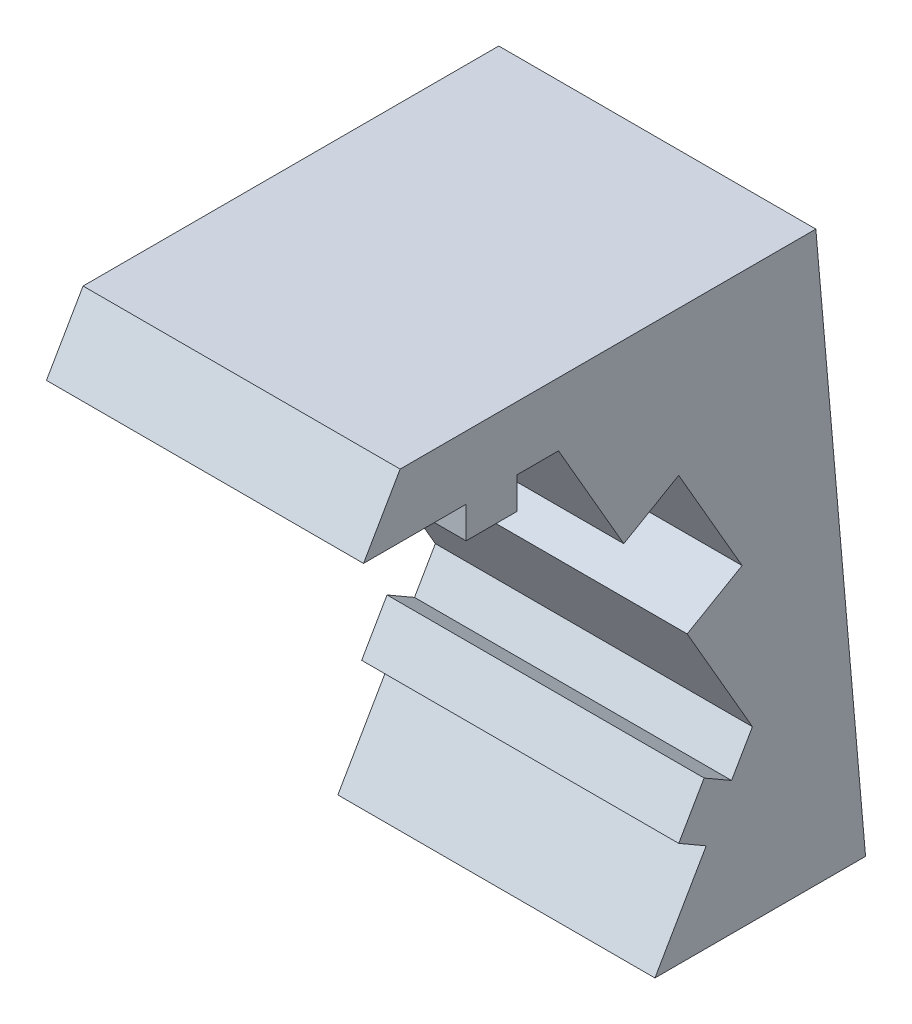
ISO-10303-21;
HEADER;
FILE_DESCRIPTION(('STEP AP214'),'2;1');
FILE_NAME('part.step','',(''),(''),'','','');
FILE_SCHEMA(('AUTOMOTIVE_DESIGN { 1 0 10303 214 1 1 1 1 }'));
ENDSEC;
DATA;
#1=APPLICATION_CONTEXT('core data for automotive mechanical design processes');
#2=APPLICATION_PROTOCOL_DEFINITION('international standard','automotive_design',2000,#1);
#3=PRODUCT_CONTEXT('',#1,'mechanical');
#4=PRODUCT('Part','Part','',(#3));
#5=PRODUCT_RELATED_PRODUCT_CATEGORY('part','',(#4));
#6=PRODUCT_DEFINITION_FORMATION('','',#4);
#7=PRODUCT_DEFINITION_CONTEXT('part definition',#1,'design');
#8=PRODUCT_DEFINITION('design','',#6,#7);
#9=PRODUCT_DEFINITION_SHAPE('','',#8);
#10=(LENGTH_UNIT() NAMED_UNIT(*) SI_UNIT(.MILLI.,.METRE.));
#11=(NAMED_UNIT(*) PLANE_ANGLE_UNIT() SI_UNIT($,.RADIAN.));
#12=(NAMED_UNIT(*) SI_UNIT($,.STERADIAN.) SOLID_ANGLE_UNIT());
#13=UNCERTAINTY_MEASURE_WITH_UNIT(LENGTH_MEASURE(1.E-05),#10,'distance_accuracy_value','');
#14=(GEOMETRIC_REPRESENTATION_CONTEXT(3) GLOBAL_UNCERTAINTY_ASSIGNED_CONTEXT((#13)) GLOBAL_UNIT_ASSIGNED_CONTEXT((#10,
#11,#12)) REPRESENTATION_CONTEXT('',''));
#15=CARTESIAN_POINT('',(0.,0.,0.));
#16=DIRECTION('',(0.,0.,1.));
#17=DIRECTION('',(1.,0.,0.));
#18=AXIS2_PLACEMENT_3D('',#15,#16,#17);
#19=CARTESIAN_POINT('',(40.25,5.29615242270663,-9.17320508075689));
#20=DIRECTION('',(0.,0.5,-0.866025403784439));
#21=DIRECTION('',(0.,0.866025403784439,0.5));
#22=AXIS2_PLACEMENT_3D('',#19,#20,#21);
#23=PLANE('',#22);
#24=DIRECTION('',(0.,0.866025403784439,0.5));
#25=VECTOR('',#24,1.);
#26=CARTESIAN_POINT('',(50.25,5.29615242270663,-9.17320508075689));
#27=LINE('',#26,#25);
#28=CARTESIAN_POINT('',(50.25,7.02820323027551,-8.17320508075689));
#29=VERTEX_POINT('',#28);
#30=CARTESIAN_POINT('',(50.25,10.5923048454133,-6.11547005383793));
#31=VERTEX_POINT('',#30);
#32=EDGE_CURVE('E195',#29,#31,#27,.T.);
#33=ORIENTED_EDGE('',*,*,#32,.T.);
#34=DIRECTION('',(1.,0.,0.));
#35=VECTOR('',#34,1.);
#36=CARTESIAN_POINT('',(40.25,10.5923048454133,-6.11547005383793));
#37=LINE('',#36,#35);
#38=CARTESIAN_POINT('',(40.25,10.5923048454133,-6.11547005383793));
#39=VERTEX_POINT('',#38);
#40=EDGE_CURVE('E11',#39,#31,#37,.T.);
#41=ORIENTED_EDGE('',*,*,#40,.F.);
#42=DIRECTION('',(0.,0.866025403784439,0.5));
#43=VECTOR('',#42,1.);
#44=CARTESIAN_POINT('',(40.25,5.29615242270663,-9.17320508075689));
#45=LINE('',#44,#43);
#46=CARTESIAN_POINT('',(40.25,7.02820323027551,-8.17320508075689));
#47=VERTEX_POINT('',#46);
#48=EDGE_CURVE('E239',#47,#39,#45,.T.);
#49=ORIENTED_EDGE('',*,*,#48,.F.);
#50=DIRECTION('',(1.,0.,0.));
#51=VECTOR('',#50,1.);
#52=CARTESIAN_POINT('',(40.25,7.02820323027551,-8.17320508075689));
#53=LINE('',#52,#51);
#54=EDGE_CURVE('E36',#47,#29,#53,.T.);
#55=ORIENTED_EDGE('',*,*,#54,.T.);
#56=EDGE_LOOP('',(#33,#41,#49,#55));
#57=FACE_BOUND('',#56,.T.);
#58=ADVANCED_FACE('F33',(#57),#23,.F.);
#59=CARTESIAN_POINT('',(40.25,10.5923048454133,0.));
#60=DIRECTION('',(0.,1.,0.));
#61=DIRECTION('',(0.,0.,1.));
#62=AXIS2_PLACEMENT_3D('',#59,#60,#61);
#63=PLANE('',#62);
#64=DIRECTION('',(0.,0.,1.));
#65=VECTOR('',#64,1.);
#66=CARTESIAN_POINT('',(50.25,10.5923048454133,0.));
#67=LINE('',#66,#65);
#68=CARTESIAN_POINT('',(50.25,10.5923048454133,-4.8));
#69=VERTEX_POINT('',#68);
#70=EDGE_CURVE('E109',#31,#69,#67,.T.);
#71=ORIENTED_EDGE('',*,*,#70,.T.);
#72=DIRECTION('',(1.,0.,0.));
#73=VECTOR('',#72,1.);
#74=CARTESIAN_POINT('',(40.25,10.5923048454133,-4.8));
#75=LINE('',#74,#73);
#76=CARTESIAN_POINT('',(40.25,10.5923048454133,-4.8));
#77=VERTEX_POINT('',#76);
#78=EDGE_CURVE('E42',#77,#69,#75,.T.);
#79=ORIENTED_EDGE('',*,*,#78,.F.);
#80=DIRECTION('',(0.,0.,1.));
#81=VECTOR('',#80,1.);
#82=CARTESIAN_POINT('',(40.25,10.5923048454133,0.));
#83=LINE('',#82,#81);
#84=EDGE_CURVE('E50',#39,#77,#83,.T.);
#85=ORIENTED_EDGE('',*,*,#84,.F.);
#86=ORIENTED_EDGE('',*,*,#40,.T.);
#87=EDGE_LOOP('',(#71,#79,#85,#86));
#88=FACE_BOUND('',#87,.T.);
#89=ADVANCED_FACE('F376',(#88),#63,.F.);
#90=CARTESIAN_POINT('',(40.25,0.,-4.8));
#91=DIRECTION('',(0.,0.,1.));
#92=DIRECTION('',(1.,0.,0.));
#93=AXIS2_PLACEMENT_3D('',#90,#91,#92);
#94=PLANE('',#93);
#95=DIRECTION('',(0.,-1.,0.));
#96=VECTOR('',#95,1.);
#97=CARTESIAN_POINT('',(50.25,0.,-4.8));
#98=LINE('',#97,#96);
#99=CARTESIAN_POINT('',(50.25,9.59230484541327,-4.8));
#100=VERTEX_POINT('',#99);
#101=EDGE_CURVE('E180',#69,#100,#98,.T.);
#102=ORIENTED_EDGE('',*,*,#101,.T.);
#103=DIRECTION('',(1.,0.,0.));
#104=VECTOR('',#103,1.);
#105=CARTESIAN_POINT('',(40.25,9.59230484541327,-4.8));
#106=LINE('',#105,#104);
#107=CARTESIAN_POINT('',(40.25,9.59230484541327,-4.8));
#108=VERTEX_POINT('',#107);
#109=EDGE_CURVE('E178',#108,#100,#106,.T.);
#110=ORIENTED_EDGE('',*,*,#109,.F.);
#111=DIRECTION('',(0.,-1.,0.));
#112=VECTOR('',#111,1.);
#113=CARTESIAN_POINT('',(40.25,0.,-4.8));
#114=LINE('',#113,#112);
#115=EDGE_CURVE('E169',#77,#108,#114,.T.);
#116=ORIENTED_EDGE('',*,*,#115,.F.);
#117=ORIENTED_EDGE('',*,*,#78,.T.);
#118=EDGE_LOOP('',(#102,#110,#116,#117));
#119=FACE_BOUND('',#118,.T.);
#120=ADVANCED_FACE('F179',(#119),#94,.F.);
#121=CARTESIAN_POINT('',(40.25,9.59230484541327,0.));
#122=DIRECTION('',(0.,1.,0.));
#123=DIRECTION('',(0.,0.,1.));
#124=AXIS2_PLACEMENT_3D('',#121,#122,#123);
#125=PLANE('',#124);
#126=DIRECTION('',(0.,0.,1.));
#127=VECTOR('',#126,1.);
#128=CARTESIAN_POINT('',(50.25,9.59230484541327,0.));
#129=LINE('',#128,#127);
#130=CARTESIAN_POINT('',(50.25,9.59230484541327,-3.2));
#131=VERTEX_POINT('',#130);
#132=EDGE_CURVE('E236',#100,#131,#129,.T.);
#133=ORIENTED_EDGE('',*,*,#132,.T.);
#134=DIRECTION('',(1.,0.,0.));
#135=VECTOR('',#134,1.);
#136=CARTESIAN_POINT('',(40.25,9.59230484541327,-3.2));
#137=LINE('',#136,#135);
#138=CARTESIAN_POINT('',(40.25,9.59230484541327,-3.2));
#139=VERTEX_POINT('',#138);
#140=EDGE_CURVE('E183',#139,#131,#137,.T.);
#141=ORIENTED_EDGE('',*,*,#140,.F.);
#142=DIRECTION('',(0.,0.,1.));
#143=VECTOR('',#142,1.);
#144=CARTESIAN_POINT('',(40.25,9.59230484541327,0.));
#145=LINE('',#144,#143);
#146=EDGE_CURVE('E173',#108,#139,#145,.T.);
#147=ORIENTED_EDGE('',*,*,#146,.F.);
#148=ORIENTED_EDGE('',*,*,#109,.T.);
#149=EDGE_LOOP('',(#133,#141,#147,#148));
#150=FACE_BOUND('',#149,.T.);
#151=ADVANCED_FACE('F185',(#150),#125,.F.);
#152=CARTESIAN_POINT('',(40.25,0.,-3.2));
#153=DIRECTION('',(0.,0.,-1.));
#154=DIRECTION('',(-1.,0.,0.));
#155=AXIS2_PLACEMENT_3D('',#152,#153,#154);
#156=PLANE('',#155);
#157=DIRECTION('',(0.,1.,0.));
#158=VECTOR('',#157,1.);
#159=CARTESIAN_POINT('',(50.25,0.,-3.2));
#160=LINE('',#159,#158);
#161=CARTESIAN_POINT('',(50.25,10.5923048454133,-3.2));
#162=VERTEX_POINT('',#161);
#163=EDGE_CURVE('E234',#131,#162,#160,.T.);
#164=ORIENTED_EDGE('',*,*,#163,.T.);
#165=DIRECTION('',(1.,0.,0.));
#166=VECTOR('',#165,1.);
#167=CARTESIAN_POINT('',(40.25,10.5923048454133,-3.2));
#168=LINE('',#167,#166);
#169=CARTESIAN_POINT('',(40.25,10.5923048454133,-3.2));
#170=VERTEX_POINT('',#169);
#171=EDGE_CURVE('E243',#170,#162,#168,.T.);
#172=ORIENTED_EDGE('',*,*,#171,.F.);
#173=DIRECTION('',(0.,1.,0.));
#174=VECTOR('',#173,1.);
#175=CARTESIAN_POINT('',(40.25,0.,-3.2));
#176=LINE('',#175,#174);
#177=EDGE_CURVE('E188',#139,#170,#176,.T.);
#178=ORIENTED_EDGE('',*,*,#177,.F.);
#179=ORIENTED_EDGE('',*,*,#140,.T.);
#180=EDGE_LOOP('',(#164,#172,#178,#179));
#181=FACE_BOUND('',#180,.T.);
#182=ADVANCED_FACE('F358',(#181),#156,.F.);
#183=CARTESIAN_POINT('',(40.25,10.5923048454133,0.));
#184=DIRECTION('',(0.,1.,0.));
#185=DIRECTION('',(0.,0.,1.));
#186=AXIS2_PLACEMENT_3D('',#183,#184,#185);
#187=PLANE('',#186);
#188=DIRECTION('',(0.,0.,1.));
#189=VECTOR('',#188,1.);
#190=CARTESIAN_POINT('',(50.25,10.5923048454133,0.));
#191=LINE('',#190,#189);
#192=CARTESIAN_POINT('',(50.25,10.5923048454133,0.0342722073549398));
#193=VERTEX_POINT('',#192);
#194=EDGE_CURVE('E231',#162,#193,#191,.T.);
#195=ORIENTED_EDGE('',*,*,#194,.T.);
#196=DIRECTION('',(1.,0.,0.));
#197=VECTOR('',#196,1.);
#198=CARTESIAN_POINT('',(40.25,10.5923048454133,0.0342722073549398));
#199=LINE('',#198,#197);
#200=CARTESIAN_POINT('',(40.25,10.5923048454133,0.0342722073549398));
#201=VERTEX_POINT('',#200);
#202=EDGE_CURVE('E246',#201,#193,#199,.T.);
#203=ORIENTED_EDGE('',*,*,#202,.F.);
#204=DIRECTION('',(0.,0.,1.));
#205=VECTOR('',#204,1.);
#206=CARTESIAN_POINT('',(40.25,10.5923048454133,0.));
#207=LINE('',#206,#205);
#208=EDGE_CURVE('E190',#170,#201,#207,.T.);
#209=ORIENTED_EDGE('',*,*,#208,.F.);
#210=ORIENTED_EDGE('',*,*,#171,.T.);
#211=EDGE_LOOP('',(#195,#203,#209,#210));
#212=FACE_BOUND('',#211,.T.);
#213=ADVANCED_FACE('F354',(#212),#187,.F.);
#214=CARTESIAN_POINT('',(40.25,2.66291651245988,4.61230669589464));
#215=DIRECTION('',(0.,0.499999999999999,0.866025403784439));
#216=DIRECTION('',(0.,-0.866025403784439,0.499999999999999));
#217=AXIS2_PLACEMENT_3D('',#214,#215,#216);
#218=PLANE('',#217);
#219=DIRECTION('',(0.,-0.866025403784439,0.499999999999999));
#220=VECTOR('',#219,1.);
#221=CARTESIAN_POINT('',(50.25,2.66291651245988,4.61230669589464));
#222=LINE('',#221,#220);
#223=CARTESIAN_POINT('',(50.25,12.5923048454133,-1.12042833102431));
#224=VERTEX_POINT('',#223);
#225=EDGE_CURVE('E228',#224,#193,#222,.T.);
#226=ORIENTED_EDGE('',*,*,#225,.F.);
#227=DIRECTION('',(1.,0.,0.));
#228=VECTOR('',#227,1.);
#229=CARTESIAN_POINT('',(40.25,12.5923048454133,-1.12042833102431));
#230=LINE('',#229,#228);
#231=CARTESIAN_POINT('',(40.25,12.5923048454133,-1.12042833102431));
#232=VERTEX_POINT('',#231);
#233=EDGE_CURVE('E248',#232,#224,#230,.T.);
#234=ORIENTED_EDGE('',*,*,#233,.F.);
#235=DIRECTION('',(0.,-0.866025403784439,0.499999999999999));
#236=VECTOR('',#235,1.);
#237=CARTESIAN_POINT('',(40.25,2.66291651245988,4.61230669589464));
#238=LINE('',#237,#236);
#239=EDGE_CURVE('E359',#232,#201,#238,.T.);
#240=ORIENTED_EDGE('',*,*,#239,.T.);
#241=ORIENTED_EDGE('',*,*,#202,.T.);
#242=EDGE_LOOP('',(#226,#234,#240,#241));
#243=FACE_BOUND('',#242,.T.);
#244=ADVANCED_FACE('F349',(#243),#218,.T.);
#245=CARTESIAN_POINT('',(40.25,12.5923048454133,0.));
#246=DIRECTION('',(0.,1.,0.));
#247=DIRECTION('',(0.,0.,1.));
#248=AXIS2_PLACEMENT_3D('',#245,#246,#247);
#249=PLANE('',#248);
#250=DIRECTION('',(0.,0.,1.));
#251=VECTOR('',#250,1.);
#252=CARTESIAN_POINT('',(50.25,12.5923048454133,0.));
#253=LINE('',#252,#251);
#254=CARTESIAN_POINT('',(50.25,12.5923048454133,-14.2309401076759));
#255=VERTEX_POINT('',#254);
#256=EDGE_CURVE('E225',#255,#224,#253,.T.);
#257=ORIENTED_EDGE('',*,*,#256,.F.);
#258=DIRECTION('',(1.,0.,0.));
#259=VECTOR('',#258,1.);
#260=CARTESIAN_POINT('',(40.25,12.5923048454133,-14.2309401076759));
#261=LINE('',#260,#259);
#262=CARTESIAN_POINT('',(40.25,12.5923048454133,-14.2309401076759));
#263=VERTEX_POINT('',#262);
#264=EDGE_CURVE('E250',#263,#255,#261,.T.);
#265=ORIENTED_EDGE('',*,*,#264,.F.);
#266=DIRECTION('',(0.,0.,1.));
#267=VECTOR('',#266,1.);
#268=CARTESIAN_POINT('',(40.25,12.5923048454133,0.));
#269=LINE('',#268,#267);
#270=EDGE_CURVE('E345',#263,#232,#269,.T.);
#271=ORIENTED_EDGE('',*,*,#270,.T.);
#272=ORIENTED_EDGE('',*,*,#233,.T.);
#273=EDGE_LOOP('',(#257,#265,#271,#272));
#274=FACE_BOUND('',#273,.T.);
#275=ADVANCED_FACE('F341',(#274),#249,.T.);
#276=CARTESIAN_POINT('',(40.25,1.33124111077101,-15.2161555236999));
#277=DIRECTION('',(0.,-0.0871557427476515,0.996194698091746));
#278=DIRECTION('',(0.,-0.996194698091746,-0.0871557427476515));
#279=AXIS2_PLACEMENT_3D('',#276,#277,#278);
#280=PLANE('',#279);
#281=DIRECTION('',(0.,-0.996194698091746,-0.0871557427476515));
#282=VECTOR('',#281,1.);
#283=CARTESIAN_POINT('',(50.25,1.33124111077101,-15.2161555236999));
#284=LINE('',#283,#282);
#285=CARTESIAN_POINT('',(50.25,-5.32583302491977,-15.7985740428244));
#286=VERTEX_POINT('',#285);
#287=EDGE_CURVE('E222',#255,#286,#284,.T.);
#288=ORIENTED_EDGE('',*,*,#287,.T.);
#289=DIRECTION('',(1.,0.,0.));
#290=VECTOR('',#289,1.);
#291=CARTESIAN_POINT('',(40.25,-5.32583302491977,-15.7985740428244));
#292=LINE('',#291,#290);
#293=CARTESIAN_POINT('',(40.25,-5.32583302491977,-15.7985740428244));
#294=VERTEX_POINT('',#293);
#295=EDGE_CURVE('E252',#294,#286,#292,.T.);
#296=ORIENTED_EDGE('',*,*,#295,.F.);
#297=DIRECTION('',(0.,-0.996194698091746,-0.0871557427476515));
#298=VECTOR('',#297,1.);
#299=CARTESIAN_POINT('',(40.25,1.33124111077101,-15.2161555236999));
#300=LINE('',#299,#298);
#301=EDGE_CURVE('E363',#263,#294,#300,.T.);
#302=ORIENTED_EDGE('',*,*,#301,.F.);
#303=ORIENTED_EDGE('',*,*,#264,.T.);
#304=EDGE_LOOP('',(#288,#296,#302,#303));
#305=FACE_BOUND('',#304,.T.);
#306=ADVANCED_FACE('F338',(#305),#280,.F.);
#307=CARTESIAN_POINT('',(40.25,-5.32583302491977,0.));
#308=DIRECTION('',(0.,-1.,0.));
#309=DIRECTION('',(0.,0.,-1.));
#310=AXIS2_PLACEMENT_3D('',#307,#308,#309);
#311=PLANE('',#310);
#312=DIRECTION('',(0.,0.,-1.));
#313=VECTOR('',#312,1.);
#314=CARTESIAN_POINT('',(50.25,-5.32583302491977,0.));
#315=LINE('',#314,#313);
#316=CARTESIAN_POINT('',(50.25,-5.32583302491977,-9.15606897707943));
#317=VERTEX_POINT('',#316);
#318=EDGE_CURVE('E219',#317,#286,#315,.T.);
#319=ORIENTED_EDGE('',*,*,#318,.F.);
#320=DIRECTION('',(1.,0.,0.));
#321=VECTOR('',#320,1.);
#322=CARTESIAN_POINT('',(40.25,-5.32583302491977,-9.15606897707943));
#323=LINE('',#322,#321);
#324=CARTESIAN_POINT('',(40.25,-5.32583302491977,-9.15606897707943));
#325=VERTEX_POINT('',#324);
#326=EDGE_CURVE('E254',#325,#317,#323,.T.);
#327=ORIENTED_EDGE('',*,*,#326,.F.);
#328=DIRECTION('',(0.,0.,-1.));
#329=VECTOR('',#328,1.);
#330=CARTESIAN_POINT('',(40.25,-5.32583302491977,0.));
#331=LINE('',#330,#329);
#332=EDGE_CURVE('E335',#325,#294,#331,.T.);
#333=ORIENTED_EDGE('',*,*,#332,.T.);
#334=ORIENTED_EDGE('',*,*,#295,.T.);
#335=EDGE_LOOP('',(#319,#327,#333,#334));
#336=FACE_BOUND('',#335,.T.);
#337=ADVANCED_FACE('F332',(#336),#311,.T.);
#338=CARTESIAN_POINT('',(40.25,-5.29615242270663,-9.17320508075689));
#339=DIRECTION('',(0.,-0.5,-0.866025403784439));
#340=DIRECTION('',(0.,0.866025403784439,-0.5));
#341=AXIS2_PLACEMENT_3D('',#338,#339,#340);
#342=PLANE('',#341);
#343=DIRECTION('',(0.,0.866025403784439,-0.5));
#344=VECTOR('',#343,1.);
#345=CARTESIAN_POINT('',(50.25,-5.29615242270663,-9.17320508075689));
#346=LINE('',#345,#344);
#347=CARTESIAN_POINT('',(50.25,-2.52487113059642,-10.7732050807569));
#348=VERTEX_POINT('',#347);
#349=EDGE_CURVE('E217',#317,#348,#346,.T.);
#350=ORIENTED_EDGE('',*,*,#349,.T.);
#351=DIRECTION('',(1.,0.,0.));
#352=VECTOR('',#351,1.);
#353=CARTESIAN_POINT('',(40.25,-2.52487113059642,-10.7732050807569));
#354=LINE('',#353,#352);
#355=CARTESIAN_POINT('',(40.25,-2.52487113059642,-10.7732050807569));
#356=VERTEX_POINT('',#355);
#357=EDGE_CURVE('E256',#356,#348,#354,.T.);
#358=ORIENTED_EDGE('',*,*,#357,.F.);
#359=DIRECTION('',(0.,0.866025403784439,-0.5));
#360=VECTOR('',#359,1.);
#361=CARTESIAN_POINT('',(40.25,-5.29615242270663,-9.17320508075689));
#362=LINE('',#361,#360);
#363=EDGE_CURVE('E327',#325,#356,#362,.T.);
#364=ORIENTED_EDGE('',*,*,#363,.F.);
#365=ORIENTED_EDGE('',*,*,#326,.T.);
#366=EDGE_LOOP('',(#350,#358,#364,#365));
#367=FACE_BOUND('',#366,.T.);
#368=ADVANCED_FACE('F326',(#367),#342,.F.);
#369=CARTESIAN_POINT('',(40.25,2.77128129211022,-1.60000000000001));
#370=DIRECTION('',(0.,0.866025403784438,-0.500000000000001));
#371=DIRECTION('',(0.,0.500000000000001,0.866025403784438));
#372=AXIS2_PLACEMENT_3D('',#369,#370,#371);
#373=PLANE('',#372);
#374=DIRECTION('',(0.,0.500000000000001,0.866025403784438));
#375=VECTOR('',#374,1.);
#376=CARTESIAN_POINT('',(50.25,2.77128129211022,-1.60000000000001));
#377=LINE('',#376,#375);
#378=CARTESIAN_POINT('',(50.25,-2.02487113059642,-9.90717967697245));
#379=VERTEX_POINT('',#378);
#380=EDGE_CURVE('E215',#348,#379,#377,.T.);
#381=ORIENTED_EDGE('',*,*,#380,.T.);
#382=DIRECTION('',(1.,0.,0.));
#383=VECTOR('',#382,1.);
#384=CARTESIAN_POINT('',(40.25,-2.02487113059642,-9.90717967697245));
#385=LINE('',#384,#383);
#386=CARTESIAN_POINT('',(40.25,-2.02487113059642,-9.90717967697245));
#387=VERTEX_POINT('',#386);
#388=EDGE_CURVE('E259',#387,#379,#385,.T.);
#389=ORIENTED_EDGE('',*,*,#388,.F.);
#390=DIRECTION('',(0.,0.500000000000001,0.866025403784438));
#391=VECTOR('',#390,1.);
#392=CARTESIAN_POINT('',(40.25,2.77128129211022,-1.60000000000001));
#393=LINE('',#392,#391);
#394=EDGE_CURVE('E322',#356,#387,#393,.T.);
#395=ORIENTED_EDGE('',*,*,#394,.F.);
#396=ORIENTED_EDGE('',*,*,#357,.T.);
#397=EDGE_LOOP('',(#381,#389,#395,#396));
#398=FACE_BOUND('',#397,.T.);
#399=ADVANCED_FACE('F321',(#398),#373,.F.);
#400=CARTESIAN_POINT('',(40.25,-4.79615242270663,-8.30717967697245));
#401=DIRECTION('',(0.,-0.5,-0.866025403784439));
#402=DIRECTION('',(0.,0.866025403784439,-0.5));
#403=AXIS2_PLACEMENT_3D('',#400,#401,#402);
#404=PLANE('',#403);
#405=DIRECTION('',(0.,0.866025403784439,-0.5));
#406=VECTOR('',#405,1.);
#407=CARTESIAN_POINT('',(50.25,-4.79615242270663,-8.30717967697245));
#408=LINE('',#407,#406);
#409=CARTESIAN_POINT('',(50.25,-0.639230484541317,-10.7071796769725));
#410=VERTEX_POINT('',#409);
#411=EDGE_CURVE('E213',#379,#410,#408,.T.);
#412=ORIENTED_EDGE('',*,*,#411,.T.);
#413=DIRECTION('',(1.,0.,0.));
#414=VECTOR('',#413,1.);
#415=CARTESIAN_POINT('',(40.25,-0.639230484541317,-10.7071796769725));
#416=LINE('',#415,#414);
#417=CARTESIAN_POINT('',(40.25,-0.639230484541317,-10.7071796769725));
#418=VERTEX_POINT('',#417);
#419=EDGE_CURVE('E262',#418,#410,#416,.T.);
#420=ORIENTED_EDGE('',*,*,#419,.F.);
#421=DIRECTION('',(0.,0.866025403784439,-0.5));
#422=VECTOR('',#421,1.);
#423=CARTESIAN_POINT('',(40.25,-4.79615242270663,-8.30717967697245));
#424=LINE('',#423,#422);
#425=EDGE_CURVE('E318',#387,#418,#424,.T.);
#426=ORIENTED_EDGE('',*,*,#425,.F.);
#427=ORIENTED_EDGE('',*,*,#388,.T.);
#428=EDGE_LOOP('',(#412,#420,#426,#427));
#429=FACE_BOUND('',#428,.T.);
#430=ADVANCED_FACE('F315',(#429),#404,.F.);
#431=CARTESIAN_POINT('',(40.25,4.15692193816531,-2.4));
#432=DIRECTION('',(0.,-0.866025403784439,0.5));
#433=DIRECTION('',(0.,-0.5,-0.866025403784439));
#434=AXIS2_PLACEMENT_3D('',#431,#432,#433);
#435=PLANE('',#434);
#436=DIRECTION('',(0.,-0.5,-0.866025403784439));
#437=VECTOR('',#436,1.);
#438=CARTESIAN_POINT('',(50.25,4.15692193816531,-2.4));
#439=LINE('',#438,#437);
#440=CARTESIAN_POINT('',(50.25,-1.13923048454132,-11.5732050807569));
#441=VERTEX_POINT('',#440);
#442=EDGE_CURVE('E211',#410,#441,#439,.T.);
#443=ORIENTED_EDGE('',*,*,#442,.T.);
#444=DIRECTION('',(1.,0.,0.));
#445=VECTOR('',#444,1.);
#446=CARTESIAN_POINT('',(40.25,-1.13923048454132,-11.5732050807569));
#447=LINE('',#446,#445);
#448=CARTESIAN_POINT('',(40.25,-1.13923048454132,-11.5732050807569));
#449=VERTEX_POINT('',#448);
#450=EDGE_CURVE('E265',#449,#441,#447,.T.);
#451=ORIENTED_EDGE('',*,*,#450,.F.);
#452=DIRECTION('',(0.,-0.5,-0.866025403784439));
#453=VECTOR('',#452,1.);
#454=CARTESIAN_POINT('',(40.25,4.15692193816531,-2.4));
#455=LINE('',#454,#453);
#456=EDGE_CURVE('E309',#418,#449,#455,.T.);
#457=ORIENTED_EDGE('',*,*,#456,.F.);
#458=ORIENTED_EDGE('',*,*,#419,.T.);
#459=EDGE_LOOP('',(#443,#451,#457,#458));
#460=FACE_BOUND('',#459,.T.);
#461=ADVANCED_FACE('F308',(#460),#435,.F.);
#462=CARTESIAN_POINT('',(40.25,-5.29615242270663,-9.17320508075689));
#463=DIRECTION('',(0.,-0.5,-0.866025403784439));
#464=DIRECTION('',(0.,0.866025403784439,-0.5));
#465=AXIS2_PLACEMENT_3D('',#462,#463,#464);
#466=PLANE('',#465);
#467=DIRECTION('',(0.,0.866025403784439,-0.5));
#468=VECTOR('',#467,1.);
#469=CARTESIAN_POINT('',(50.25,-5.29615242270663,-9.17320508075689));
#470=LINE('',#469,#468);
#471=CARTESIAN_POINT('',(50.25,0.,-12.2309401076759));
#472=VERTEX_POINT('',#471);
#473=EDGE_CURVE('E209',#441,#472,#470,.T.);
#474=ORIENTED_EDGE('',*,*,#473,.T.);
#475=DIRECTION('',(1.,0.,0.));
#476=VECTOR('',#475,1.);
#477=CARTESIAN_POINT('',(40.25,0.,-12.2309401076759));
#478=LINE('',#477,#476);
#479=CARTESIAN_POINT('',(40.25,0.,-12.2309401076759));
#480=VERTEX_POINT('',#479);
#481=EDGE_CURVE('E268',#480,#472,#478,.T.);
#482=ORIENTED_EDGE('',*,*,#481,.F.);
#483=DIRECTION('',(0.,0.866025403784439,-0.5));
#484=VECTOR('',#483,1.);
#485=CARTESIAN_POINT('',(40.25,-5.29615242270663,-9.17320508075689));
#486=LINE('',#485,#484);
#487=EDGE_CURVE('E304',#449,#480,#486,.T.);
#488=ORIENTED_EDGE('',*,*,#487,.F.);
#489=ORIENTED_EDGE('',*,*,#450,.T.);
#490=EDGE_LOOP('',(#474,#482,#488,#489));
#491=FACE_BOUND('',#490,.T.);
#492=ADVANCED_FACE('F303',(#491),#466,.F.);
#493=CARTESIAN_POINT('',(40.25,5.29615242270664,-9.17320508075689));
#494=DIRECTION('',(0.,0.5,-0.866025403784438));
#495=DIRECTION('',(0.,0.866025403784438,0.5));
#496=AXIS2_PLACEMENT_3D('',#493,#494,#495);
#497=PLANE('',#496);
#498=DIRECTION('',(0.,0.866025403784438,0.5));
#499=VECTOR('',#498,1.);
#500=CARTESIAN_POINT('',(50.25,5.29615242270664,-9.17320508075689));
#501=LINE('',#500,#499);
#502=CARTESIAN_POINT('',(50.25,3.56410161513776,-10.1732050807569));
#503=VERTEX_POINT('',#502);
#504=EDGE_CURVE('E206',#472,#503,#501,.T.);
#505=ORIENTED_EDGE('',*,*,#504,.T.);
#506=DIRECTION('',(1.,0.,0.));
#507=VECTOR('',#506,1.);
#508=CARTESIAN_POINT('',(40.25,3.56410161513776,-10.1732050807569));
#509=LINE('',#508,#507);
#510=CARTESIAN_POINT('',(40.25,3.56410161513776,-10.1732050807569));
#511=VERTEX_POINT('',#510);
#512=EDGE_CURVE('E271',#511,#503,#509,.T.);
#513=ORIENTED_EDGE('',*,*,#512,.F.);
#514=DIRECTION('',(0.,0.866025403784438,0.5));
#515=VECTOR('',#514,1.);
#516=CARTESIAN_POINT('',(40.25,5.29615242270664,-9.17320508075689));
#517=LINE('',#516,#515);
#518=EDGE_CURVE('E300',#480,#511,#517,.T.);
#519=ORIENTED_EDGE('',*,*,#518,.F.);
#520=ORIENTED_EDGE('',*,*,#481,.T.);
#521=EDGE_LOOP('',(#505,#513,#519,#520));
#522=FACE_BOUND('',#521,.T.);
#523=ADVANCED_FACE('F297',(#522),#497,.F.);
#524=CARTESIAN_POINT('',(40.25,-1.73205080756887,-0.999999999999999));
#525=DIRECTION('',(0.,0.866025403784439,0.5));
#526=DIRECTION('',(0.,-0.5,0.866025403784439));
#527=AXIS2_PLACEMENT_3D('',#524,#525,#526);
#528=PLANE('',#527);
#529=DIRECTION('',(0.,-0.5,0.866025403784439));
#530=VECTOR('',#529,1.);
#531=CARTESIAN_POINT('',(50.25,-1.73205080756887,-0.999999999999999));
#532=LINE('',#531,#530);
#533=CARTESIAN_POINT('',(50.25,4.56410161513776,-11.9052558883258));
#534=VERTEX_POINT('',#533);
#535=EDGE_CURVE('E203',#534,#503,#532,.T.);
#536=ORIENTED_EDGE('',*,*,#535,.F.);
#537=DIRECTION('',(1.,0.,0.));
#538=VECTOR('',#537,1.);
#539=CARTESIAN_POINT('',(40.25,4.56410161513776,-11.9052558883258));
#540=LINE('',#539,#538);
#541=CARTESIAN_POINT('',(40.25,4.56410161513776,-11.9052558883258));
#542=VERTEX_POINT('',#541);
#543=EDGE_CURVE('E273',#542,#534,#540,.T.);
#544=ORIENTED_EDGE('',*,*,#543,.F.);
#545=DIRECTION('',(0.,-0.5,0.866025403784439));
#546=VECTOR('',#545,1.);
#547=CARTESIAN_POINT('',(40.25,-1.73205080756887,-0.999999999999999));
#548=LINE('',#547,#546);
#549=EDGE_CURVE('E372',#542,#511,#548,.T.);
#550=ORIENTED_EDGE('',*,*,#549,.T.);
#551=ORIENTED_EDGE('',*,*,#512,.T.);
#552=EDGE_LOOP('',(#536,#544,#550,#551));
#553=FACE_BOUND('',#552,.T.);
#554=ADVANCED_FACE('F291',(#553),#528,.T.);
#555=CARTESIAN_POINT('',(40.25,6.29615242270664,-10.9052558883258));
#556=DIRECTION('',(0.,-0.500000000000001,0.866025403784438));
#557=DIRECTION('',(0.,-0.866025403784438,-0.500000000000001));
#558=AXIS2_PLACEMENT_3D('',#555,#556,#557);
#559=PLANE('',#558);
#560=DIRECTION('',(0.,-0.866025403784438,-0.500000000000001));
#561=VECTOR('',#560,1.);
#562=CARTESIAN_POINT('',(50.25,6.29615242270664,-10.9052558883258));
#563=LINE('',#562,#561);
#564=CARTESIAN_POINT('',(50.25,8.02820323027551,-9.90525588832576));
#565=VERTEX_POINT('',#564);
#566=EDGE_CURVE('E200',#565,#534,#563,.T.);
#567=ORIENTED_EDGE('',*,*,#566,.F.);
#568=DIRECTION('',(1.,0.,0.));
#569=VECTOR('',#568,1.);
#570=CARTESIAN_POINT('',(40.25,8.02820323027551,-9.90525588832576));
#571=LINE('',#570,#569);
#572=CARTESIAN_POINT('',(40.25,8.02820323027551,-9.90525588832576));
#573=VERTEX_POINT('',#572);
#574=EDGE_CURVE('E274',#573,#565,#571,.T.);
#575=ORIENTED_EDGE('',*,*,#574,.F.);
#576=DIRECTION('',(0.,-0.866025403784438,-0.500000000000001));
#577=VECTOR('',#576,1.);
#578=CARTESIAN_POINT('',(40.25,6.29615242270664,-10.9052558883258));
#579=LINE('',#578,#577);
#580=EDGE_CURVE('E287',#573,#542,#579,.T.);
#581=ORIENTED_EDGE('',*,*,#580,.T.);
#582=ORIENTED_EDGE('',*,*,#543,.T.);
#583=EDGE_LOOP('',(#567,#575,#581,#582));
#584=FACE_BOUND('',#583,.T.);
#585=ADVANCED_FACE('F284',(#584),#559,.T.);
#586=CARTESIAN_POINT('',(40.25,1.73205080756888,1.));
#587=DIRECTION('',(0.,0.866025403784439,0.5));
#588=DIRECTION('',(0.,-0.5,0.866025403784439));
#589=AXIS2_PLACEMENT_3D('',#586,#587,#588);
#590=PLANE('',#589);
#591=DIRECTION('',(0.,-0.5,0.866025403784439));
#592=VECTOR('',#591,1.);
#593=CARTESIAN_POINT('',(50.25,1.73205080756888,1.));
#594=LINE('',#593,#592);
#595=EDGE_CURVE('E198',#565,#29,#594,.T.);
#596=ORIENTED_EDGE('',*,*,#595,.T.);
#597=ORIENTED_EDGE('',*,*,#54,.F.);
#598=DIRECTION('',(0.,-0.5,0.866025403784439));
#599=VECTOR('',#598,1.);
#600=CARTESIAN_POINT('',(40.25,1.73205080756888,1.));
#601=LINE('',#600,#599);
#602=EDGE_CURVE('E121',#573,#47,#601,.T.);
#603=ORIENTED_EDGE('',*,*,#602,.F.);
#604=ORIENTED_EDGE('',*,*,#574,.T.);
#605=EDGE_LOOP('',(#596,#597,#603,#604));
#606=FACE_BOUND('',#605,.T.);
#607=ADVANCED_FACE('F416',(#606),#590,.F.);
#608=CARTESIAN_POINT('',(40.25,0.,0.));
#609=DIRECTION('',(1.,0.,0.));
#610=DIRECTION('',(0.,0.,-1.));
#611=AXIS2_PLACEMENT_3D('',#608,#609,#610);
#612=PLANE('',#611);
#613=ORIENTED_EDGE('',*,*,#48,.T.);
#614=ORIENTED_EDGE('',*,*,#84,.T.);
#615=ORIENTED_EDGE('',*,*,#115,.T.);
#616=ORIENTED_EDGE('',*,*,#146,.T.);
#617=ORIENTED_EDGE('',*,*,#177,.T.);
#618=ORIENTED_EDGE('',*,*,#208,.T.);
#619=ORIENTED_EDGE('',*,*,#239,.F.);
#620=ORIENTED_EDGE('',*,*,#270,.F.);
#621=ORIENTED_EDGE('',*,*,#301,.T.);
#622=ORIENTED_EDGE('',*,*,#332,.F.);
#623=ORIENTED_EDGE('',*,*,#363,.T.);
#624=ORIENTED_EDGE('',*,*,#394,.T.);
#625=ORIENTED_EDGE('',*,*,#425,.T.);
#626=ORIENTED_EDGE('',*,*,#456,.T.);
#627=ORIENTED_EDGE('',*,*,#487,.T.);
#628=ORIENTED_EDGE('',*,*,#518,.T.);
#629=ORIENTED_EDGE('',*,*,#549,.F.);
#630=ORIENTED_EDGE('',*,*,#580,.F.);
#631=ORIENTED_EDGE('',*,*,#602,.T.);
#632=EDGE_LOOP('',(#613,#614,#615,#616,#617,#618,#619,#620,#621,#622,#623,#624,#625,#626,#627,
#628,#629,#630,#631));
#633=FACE_BOUND('',#632,.T.);
#634=ADVANCED_FACE('F171',(#633),#612,.F.);
#635=CARTESIAN_POINT('',(50.25,0.,0.));
#636=DIRECTION('',(1.,0.,0.));
#637=DIRECTION('',(0.,0.,-1.));
#638=AXIS2_PLACEMENT_3D('',#635,#636,#637);
#639=PLANE('',#638);
#640=ORIENTED_EDGE('',*,*,#32,.F.);
#641=ORIENTED_EDGE('',*,*,#595,.F.);
#642=ORIENTED_EDGE('',*,*,#566,.T.);
#643=ORIENTED_EDGE('',*,*,#535,.T.);
#644=ORIENTED_EDGE('',*,*,#504,.F.);
#645=ORIENTED_EDGE('',*,*,#473,.F.);
#646=ORIENTED_EDGE('',*,*,#442,.F.);
#647=ORIENTED_EDGE('',*,*,#411,.F.);
#648=ORIENTED_EDGE('',*,*,#380,.F.);
#649=ORIENTED_EDGE('',*,*,#349,.F.);
#650=ORIENTED_EDGE('',*,*,#318,.T.);
#651=ORIENTED_EDGE('',*,*,#287,.F.);
#652=ORIENTED_EDGE('',*,*,#256,.T.);
#653=ORIENTED_EDGE('',*,*,#225,.T.);
#654=ORIENTED_EDGE('',*,*,#194,.F.);
#655=ORIENTED_EDGE('',*,*,#163,.F.);
#656=ORIENTED_EDGE('',*,*,#132,.F.);
#657=ORIENTED_EDGE('',*,*,#101,.F.);
#658=ORIENTED_EDGE('',*,*,#70,.F.);
#659=EDGE_LOOP('',(#640,#641,#642,#643,#644,#645,#646,#647,#648,#649,#650,#651,#652,#653,#654,
#655,#656,#657,#658));
#660=FACE_BOUND('',#659,.T.);
#661=ADVANCED_FACE('F281',(#660),#639,.T.);
#662=CLOSED_SHELL('',(#58,#89,#120,#151,#182,#213,#244,#275,#306,#337,#368,#399,#430,#461,#492,
#523,#554,#585,#607,#634,#661));
#663=MANIFOLD_SOLID_BREP('B2',#662);
#664=ADVANCED_BREP_SHAPE_REPRESENTATION('',(#18,#663),#14);
#665=SHAPE_DEFINITION_REPRESENTATION(#9,#664);
ENDSEC;
END-ISO-10303-21;
